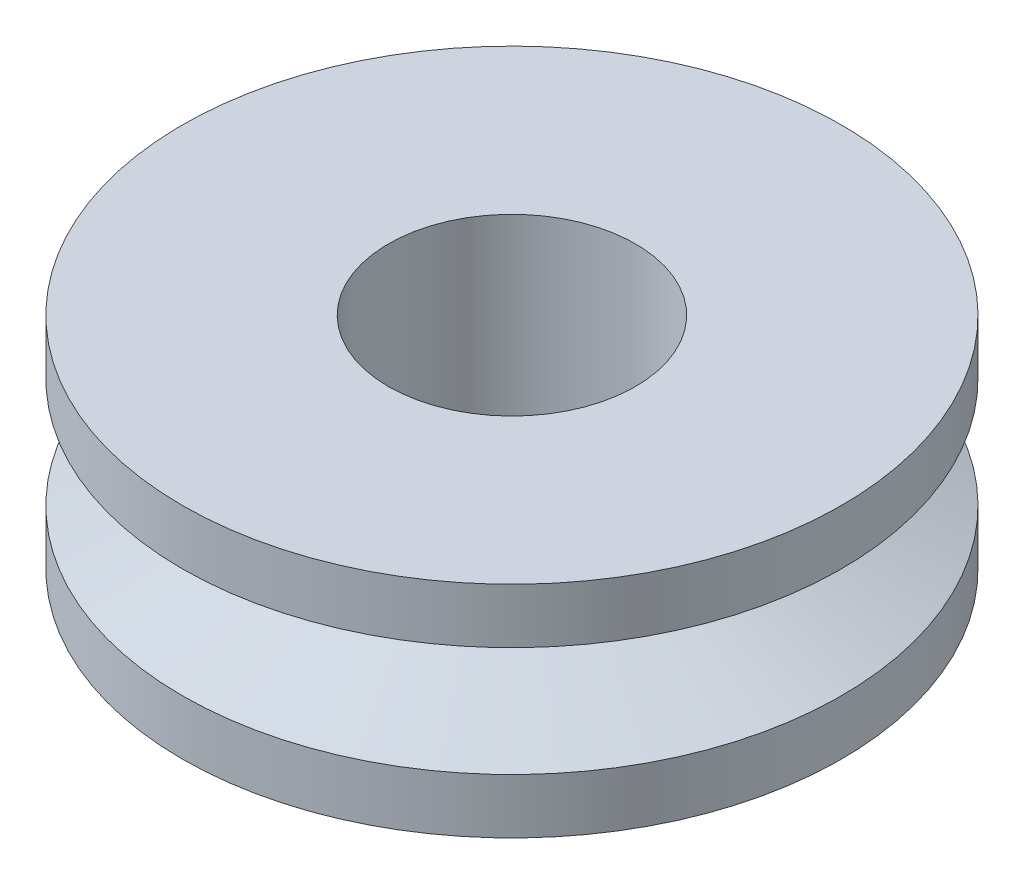
ISO-10303-21;
HEADER;
FILE_DESCRIPTION(('STEP AP214'),'2;1');
FILE_NAME('part.step','',(''),(''),'','','');
FILE_SCHEMA(('AUTOMOTIVE_DESIGN { 1 0 10303 214 1 1 1 1 }'));
ENDSEC;
DATA;
#1=APPLICATION_CONTEXT('core data for automotive mechanical design processes');
#2=APPLICATION_PROTOCOL_DEFINITION('international standard','automotive_design',2000,#1);
#3=PRODUCT_CONTEXT('',#1,'mechanical');
#4=PRODUCT('Part','Part','',(#3));
#5=PRODUCT_RELATED_PRODUCT_CATEGORY('part','',(#4));
#6=PRODUCT_DEFINITION_FORMATION('','',#4);
#7=PRODUCT_DEFINITION_CONTEXT('part definition',#1,'design');
#8=PRODUCT_DEFINITION('design','',#6,#7);
#9=PRODUCT_DEFINITION_SHAPE('','',#8);
#10=(LENGTH_UNIT() NAMED_UNIT(*) SI_UNIT(.MILLI.,.METRE.));
#11=(NAMED_UNIT(*) PLANE_ANGLE_UNIT() SI_UNIT($,.RADIAN.));
#12=(NAMED_UNIT(*) SI_UNIT($,.STERADIAN.) SOLID_ANGLE_UNIT());
#13=UNCERTAINTY_MEASURE_WITH_UNIT(LENGTH_MEASURE(1.E-05),#10,'distance_accuracy_value','');
#14=(GEOMETRIC_REPRESENTATION_CONTEXT(3) GLOBAL_UNCERTAINTY_ASSIGNED_CONTEXT((#13)) GLOBAL_UNIT_ASSIGNED_CONTEXT((#10,
#11,#12)) REPRESENTATION_CONTEXT('',''));
#15=CARTESIAN_POINT('',(0.,0.,0.));
#16=DIRECTION('',(0.,0.,1.));
#17=DIRECTION('',(1.,0.,0.));
#18=AXIS2_PLACEMENT_3D('',#15,#16,#17);
#19=CARTESIAN_POINT('',(0.,14.3203781754507,0.));
#20=DIRECTION('',(0.,1.,0.));
#21=DIRECTION('',(0.,0.,1.));
#22=AXIS2_PLACEMENT_3D('',#19,#20,#21);
#23=CYLINDRICAL_SURFACE('',#22,15.);
#24=CARTESIAN_POINT('',(0.,5.,0.));
#25=DIRECTION('',(0.,1.,0.));
#26=DIRECTION('',(0.,0.,1.));
#27=AXIS2_PLACEMENT_3D('',#24,#25,#26);
#28=CIRCLE('',#27,15.);
#29=CARTESIAN_POINT('',(0.,5.,15.));
#30=VERTEX_POINT('',#29);
#31=EDGE_CURVE('E10',#30,#30,#28,.T.);
#32=ORIENTED_EDGE('',*,*,#31,.F.);
#33=EDGE_LOOP('',(#32));
#34=FACE_BOUND('',#33,.T.);
#35=CARTESIAN_POINT('',(0.,2.5,0.));
#36=DIRECTION('',(0.,1.,0.));
#37=DIRECTION('',(0.,0.,1.));
#38=AXIS2_PLACEMENT_3D('',#35,#36,#37);
#39=CIRCLE('',#38,15.);
#40=CARTESIAN_POINT('',(0.,2.5,15.));
#41=VERTEX_POINT('',#40);
#42=EDGE_CURVE('E60',#41,#41,#39,.T.);
#43=ORIENTED_EDGE('',*,*,#42,.T.);
#44=EDGE_LOOP('',(#43));
#45=FACE_BOUND('',#44,.T.);
#46=ADVANCED_FACE('F35',(#34,#45),#23,.T.);
#47=CARTESIAN_POINT('',(15.,5.,0.));
#48=DIRECTION('',(0.,-1.,0.));
#49=DIRECTION('',(0.,0.,-1.));
#50=AXIS2_PLACEMENT_3D('',#47,#48,#49);
#51=PLANE('',#50);
#52=CARTESIAN_POINT('',(0.,5.,0.));
#53=DIRECTION('',(0.,1.,0.));
#54=DIRECTION('',(0.,0.,1.));
#55=AXIS2_PLACEMENT_3D('',#52,#53,#54);
#56=CIRCLE('',#55,5.625);
#57=CARTESIAN_POINT('',(0.,5.,5.625));
#58=VERTEX_POINT('',#57);
#59=EDGE_CURVE('E41',#58,#58,#56,.T.);
#60=ORIENTED_EDGE('',*,*,#59,.F.);
#61=EDGE_LOOP('',(#60));
#62=FACE_BOUND('',#61,.T.);
#63=ORIENTED_EDGE('',*,*,#31,.T.);
#64=EDGE_LOOP('',(#63));
#65=FACE_BOUND('',#64,.T.);
#66=ADVANCED_FACE('F91',(#62,#65),#51,.F.);
#67=CARTESIAN_POINT('',(0.,14.3203781754507,0.));
#68=DIRECTION('',(0.,1.,0.));
#69=DIRECTION('',(0.,0.,1.));
#70=AXIS2_PLACEMENT_3D('',#67,#68,#69);
#71=CYLINDRICAL_SURFACE('',#70,5.625);
#72=CARTESIAN_POINT('',(0.,-5.,0.));
#73=DIRECTION('',(0.,1.,0.));
#74=DIRECTION('',(0.,0.,1.));
#75=AXIS2_PLACEMENT_3D('',#72,#73,#74);
#76=CIRCLE('',#75,5.625);
#77=CARTESIAN_POINT('',(0.,-5.,5.625));
#78=VERTEX_POINT('',#77);
#79=EDGE_CURVE('E45',#78,#78,#76,.T.);
#80=ORIENTED_EDGE('',*,*,#79,.F.);
#81=EDGE_LOOP('',(#80));
#82=FACE_BOUND('',#81,.T.);
#83=ORIENTED_EDGE('',*,*,#59,.T.);
#84=EDGE_LOOP('',(#83));
#85=FACE_BOUND('',#84,.T.);
#86=ADVANCED_FACE('F86',(#82,#85),#71,.F.);
#87=CARTESIAN_POINT('',(5.625,-5.,0.));
#88=DIRECTION('',(0.,1.,0.));
#89=DIRECTION('',(0.,0.,1.));
#90=AXIS2_PLACEMENT_3D('',#87,#88,#89);
#91=PLANE('',#90);
#92=CARTESIAN_POINT('',(0.,-5.,0.));
#93=DIRECTION('',(0.,1.,0.));
#94=DIRECTION('',(0.,0.,1.));
#95=AXIS2_PLACEMENT_3D('',#92,#93,#94);
#96=CIRCLE('',#95,15.);
#97=CARTESIAN_POINT('',(0.,-5.,15.));
#98=VERTEX_POINT('',#97);
#99=EDGE_CURVE('E49',#98,#98,#96,.T.);
#100=ORIENTED_EDGE('',*,*,#99,.F.);
#101=EDGE_LOOP('',(#100));
#102=FACE_BOUND('',#101,.T.);
#103=ORIENTED_EDGE('',*,*,#79,.T.);
#104=EDGE_LOOP('',(#103));
#105=FACE_BOUND('',#104,.T.);
#106=ADVANCED_FACE('F80',(#102,#105),#91,.F.);
#107=CARTESIAN_POINT('',(0.,14.3203781754507,0.));
#108=DIRECTION('',(0.,1.,0.));
#109=DIRECTION('',(0.,0.,1.));
#110=AXIS2_PLACEMENT_3D('',#107,#108,#109);
#111=CYLINDRICAL_SURFACE('',#110,15.);
#112=CARTESIAN_POINT('',(0.,-2.5,0.));
#113=DIRECTION('',(0.,1.,0.));
#114=DIRECTION('',(0.,0.,1.));
#115=AXIS2_PLACEMENT_3D('',#112,#113,#114);
#116=CIRCLE('',#115,15.);
#117=CARTESIAN_POINT('',(0.,-2.5,15.));
#118=VERTEX_POINT('',#117);
#119=EDGE_CURVE('E54',#118,#118,#116,.T.);
#120=ORIENTED_EDGE('',*,*,#119,.F.);
#121=EDGE_LOOP('',(#120));
#122=FACE_BOUND('',#121,.T.);
#123=ORIENTED_EDGE('',*,*,#99,.T.);
#124=EDGE_LOOP('',(#123));
#125=FACE_BOUND('',#124,.T.);
#126=ADVANCED_FACE('F74',(#122,#125),#111,.T.);
#127=CARTESIAN_POINT('',(0.,-2.5,0.));
#128=DIRECTION('',(0.,-1.,0.));
#129=DIRECTION('',(0.,0.,-1.));
#130=AXIS2_PLACEMENT_3D('',#127,#128,#129);
#131=CONICAL_SURFACE('',#130,15.,1.17809724509618);
#132=CARTESIAN_POINT('',(0.,0.,0.));
#133=DIRECTION('',(0.,1.,0.));
#134=DIRECTION('',(0.,0.,1.));
#135=AXIS2_PLACEMENT_3D('',#132,#133,#134);
#136=CIRCLE('',#135,8.96446609406722);
#137=CARTESIAN_POINT('',(0.,0.,8.96446609406722));
#138=VERTEX_POINT('',#137);
#139=EDGE_CURVE('E57',#138,#138,#136,.T.);
#140=ORIENTED_EDGE('',*,*,#139,.F.);
#141=EDGE_LOOP('',(#140));
#142=FACE_BOUND('',#141,.T.);
#143=ORIENTED_EDGE('',*,*,#119,.T.);
#144=EDGE_LOOP('',(#143));
#145=FACE_BOUND('',#144,.T.);
#146=ADVANCED_FACE('F68',(#142,#145),#131,.T.);
#147=CARTESIAN_POINT('',(0.,0.,0.));
#148=DIRECTION('',(0.,1.,0.));
#149=DIRECTION('',(0.,0.,1.));
#150=AXIS2_PLACEMENT_3D('',#147,#148,#149);
#151=CONICAL_SURFACE('',#150,8.96446609406722,1.17809724509618);
#152=ORIENTED_EDGE('',*,*,#42,.F.);
#153=EDGE_LOOP('',(#152));
#154=FACE_BOUND('',#153,.T.);
#155=ORIENTED_EDGE('',*,*,#139,.T.);
#156=EDGE_LOOP('',(#155));
#157=FACE_BOUND('',#156,.T.);
#158=ADVANCED_FACE('F65',(#154,#157),#151,.T.);
#159=CLOSED_SHELL('',(#46,#66,#86,#106,#126,#146,#158));
#160=MANIFOLD_SOLID_BREP('B2',#159);
#161=ADVANCED_BREP_SHAPE_REPRESENTATION('',(#18,#160),#14);
#162=SHAPE_DEFINITION_REPRESENTATION(#9,#161);
ENDSEC;
END-ISO-10303-21;
